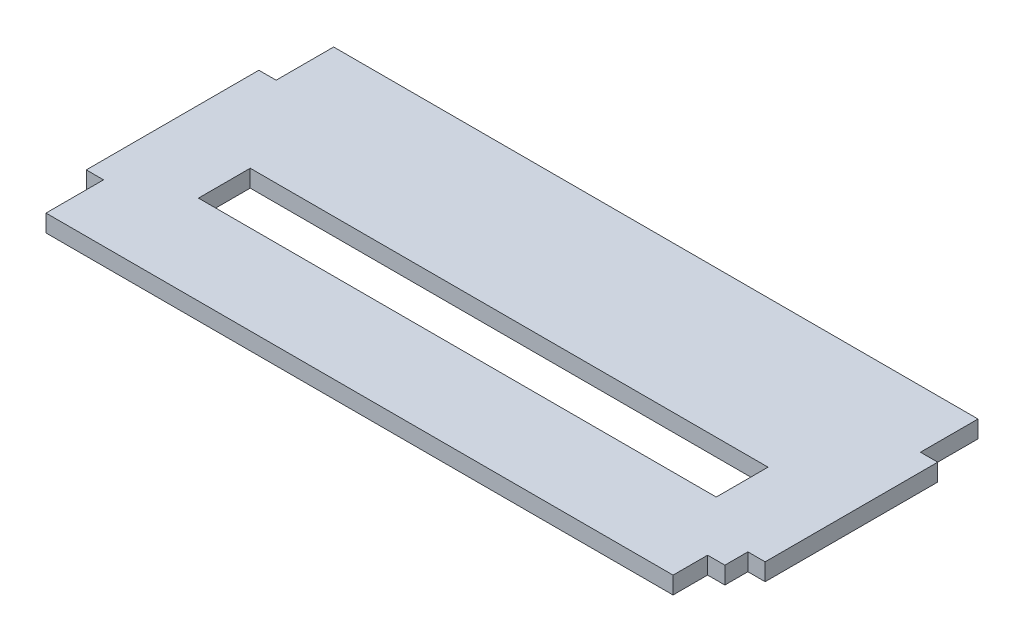
ISO-10303-21;
HEADER;
FILE_DESCRIPTION(('STEP AP214'),'2;1');
FILE_NAME('part.step','',(''),(''),'','','');
FILE_SCHEMA(('AUTOMOTIVE_DESIGN { 1 0 10303 214 1 1 1 1 }'));
ENDSEC;
DATA;
#1=APPLICATION_CONTEXT('core data for automotive mechanical design processes');
#2=APPLICATION_PROTOCOL_DEFINITION('international standard','automotive_design',2000,#1);
#3=PRODUCT_CONTEXT('',#1,'mechanical');
#4=PRODUCT('Part','Part','',(#3));
#5=PRODUCT_RELATED_PRODUCT_CATEGORY('part','',(#4));
#6=PRODUCT_DEFINITION_FORMATION('','',#4);
#7=PRODUCT_DEFINITION_CONTEXT('part definition',#1,'design');
#8=PRODUCT_DEFINITION('design','',#6,#7);
#9=PRODUCT_DEFINITION_SHAPE('','',#8);
#10=(LENGTH_UNIT() NAMED_UNIT(*) SI_UNIT(.MILLI.,.METRE.));
#11=(NAMED_UNIT(*) PLANE_ANGLE_UNIT() SI_UNIT($,.RADIAN.));
#12=(NAMED_UNIT(*) SI_UNIT($,.STERADIAN.) SOLID_ANGLE_UNIT());
#13=UNCERTAINTY_MEASURE_WITH_UNIT(LENGTH_MEASURE(1.E-05),#10,'distance_accuracy_value','');
#14=(GEOMETRIC_REPRESENTATION_CONTEXT(3) GLOBAL_UNCERTAINTY_ASSIGNED_CONTEXT((#13)) GLOBAL_UNIT_ASSIGNED_CONTEXT((#10,
#11,#12)) REPRESENTATION_CONTEXT('',''));
#15=CARTESIAN_POINT('',(0.,0.,0.));
#16=DIRECTION('',(0.,0.,1.));
#17=DIRECTION('',(1.,0.,0.));
#18=AXIS2_PLACEMENT_3D('',#15,#16,#17);
#19=CARTESIAN_POINT('',(-1.5404344466674E-12,12.,139.999999999999));
#20=DIRECTION('',(0.,0.,-1.));
#21=DIRECTION('',(-1.,0.,0.));
#22=AXIS2_PLACEMENT_3D('',#19,#20,#21);
#23=PLANE('',#22);
#24=DIRECTION('',(1.,0.,0.));
#25=VECTOR('',#24,1.);
#26=CARTESIAN_POINT('',(-1.5404344466674E-12,3.,139.999999999999));
#27=LINE('',#26,#25);
#28=CARTESIAN_POINT('',(-3.00000000000154,3.,139.999999999999));
#29=VERTEX_POINT('',#28);
#30=CARTESIAN_POINT('',(-1.5404344466674E-12,3.,139.999999999999));
#31=VERTEX_POINT('',#30);
#32=EDGE_CURVE('E208',#29,#31,#27,.T.);
#33=ORIENTED_EDGE('',*,*,#32,.F.);
#34=DIRECTION('',(0.,1.,0.));
#35=VECTOR('',#34,1.);
#36=CARTESIAN_POINT('',(-3.00000000000154,0.,139.999999999999));
#37=LINE('',#36,#35);
#38=CARTESIAN_POINT('',(-3.00000000000154,0.,139.999999999999));
#39=VERTEX_POINT('',#38);
#40=EDGE_CURVE('E255',#39,#29,#37,.T.);
#41=ORIENTED_EDGE('',*,*,#40,.F.);
#42=DIRECTION('',(1.,0.,0.));
#43=VECTOR('',#42,1.);
#44=CARTESIAN_POINT('',(-1.5404344466674E-12,0.,139.999999999999));
#45=LINE('',#44,#43);
#46=CARTESIAN_POINT('',(-1.5404344466674E-12,0.,139.999999999999));
#47=VERTEX_POINT('',#46);
#48=EDGE_CURVE('E271',#39,#47,#45,.T.);
#49=ORIENTED_EDGE('',*,*,#48,.T.);
#50=DIRECTION('',(0.,1.,0.));
#51=VECTOR('',#50,1.);
#52=CARTESIAN_POINT('',(-1.5404344466674E-12,0.,139.999999999999));
#53=LINE('',#52,#51);
#54=EDGE_CURVE('E227',#47,#31,#53,.T.);
#55=ORIENTED_EDGE('',*,*,#54,.T.);
#56=EDGE_LOOP('',(#33,#41,#49,#55));
#57=FACE_BOUND('',#56,.T.);
#58=ADVANCED_FACE('F34',(#57),#23,.F.);
#59=CARTESIAN_POINT('',(-1.62370117351429E-12,12.,109.999999999999));
#60=DIRECTION('',(0.,0.,-1.));
#61=DIRECTION('',(-1.,0.,0.));
#62=AXIS2_PLACEMENT_3D('',#59,#60,#61);
#63=PLANE('',#62);
#64=DIRECTION('',(0.,1.,0.));
#65=VECTOR('',#64,1.);
#66=CARTESIAN_POINT('',(-2.99999999999846,0.,109.999999999999));
#67=LINE('',#66,#65);
#68=CARTESIAN_POINT('',(-2.99999999999846,0.,109.999999999999));
#69=VERTEX_POINT('',#68);
#70=CARTESIAN_POINT('',(-2.99999999999846,3.,109.999999999999));
#71=VERTEX_POINT('',#70);
#72=EDGE_CURVE('E287',#69,#71,#67,.T.);
#73=ORIENTED_EDGE('',*,*,#72,.T.);
#74=DIRECTION('',(1.,0.,0.));
#75=VECTOR('',#74,1.);
#76=CARTESIAN_POINT('',(-1.62370117351429E-12,3.,109.999999999999));
#77=LINE('',#76,#75);
#78=CARTESIAN_POINT('',(-1.52395457364563E-12,3.,109.999999999999));
#79=VERTEX_POINT('',#78);
#80=EDGE_CURVE('E212',#71,#79,#77,.T.);
#81=ORIENTED_EDGE('',*,*,#80,.T.);
#82=DIRECTION('',(0.,1.,0.));
#83=VECTOR('',#82,1.);
#84=CARTESIAN_POINT('',(-3.05311331771916E-13,0.,109.999999999999));
#85=LINE('',#84,#83);
#86=CARTESIAN_POINT('',(-1.5404344466674E-12,0.,109.999999999999));
#87=VERTEX_POINT('',#86);
#88=EDGE_CURVE('E228',#87,#79,#85,.T.);
#89=ORIENTED_EDGE('',*,*,#88,.F.);
#90=DIRECTION('',(1.,0.,0.));
#91=VECTOR('',#90,1.);
#92=CARTESIAN_POINT('',(-1.62370117351429E-12,0.,109.999999999999));
#93=LINE('',#92,#91);
#94=EDGE_CURVE('E294',#69,#87,#93,.T.);
#95=ORIENTED_EDGE('',*,*,#94,.F.);
#96=EDGE_LOOP('',(#73,#81,#89,#95));
#97=FACE_BOUND('',#96,.T.);
#98=ADVANCED_FACE('F336',(#97),#63,.T.);
#99=CARTESIAN_POINT('',(-118.000000000001,12.,109.999999999999));
#100=DIRECTION('',(0.,0.,1.));
#101=DIRECTION('',(1.,0.,0.));
#102=AXIS2_PLACEMENT_3D('',#99,#100,#101);
#103=PLANE('',#102);
#104=DIRECTION('',(-1.,0.,0.));
#105=VECTOR('',#104,1.);
#106=CARTESIAN_POINT('',(-118.000000000001,3.,109.999999999999));
#107=LINE('',#106,#105);
#108=CARTESIAN_POINT('',(-115.000000000005,3.,109.999999999999));
#109=VERTEX_POINT('',#108);
#110=CARTESIAN_POINT('',(-118.000000000002,3.,109.999999999999));
#111=VERTEX_POINT('',#110);
#112=EDGE_CURVE('E218',#109,#111,#107,.T.);
#113=ORIENTED_EDGE('',*,*,#112,.F.);
#114=DIRECTION('',(0.,1.,0.));
#115=VECTOR('',#114,1.);
#116=CARTESIAN_POINT('',(-115.000000000005,0.,109.999999999999));
#117=LINE('',#116,#115);
#118=CARTESIAN_POINT('',(-115.000000000005,0.,109.999999999999));
#119=VERTEX_POINT('',#118);
#120=EDGE_CURVE('E284',#119,#109,#117,.T.);
#121=ORIENTED_EDGE('',*,*,#120,.F.);
#122=DIRECTION('',(-1.,0.,0.));
#123=VECTOR('',#122,1.);
#124=CARTESIAN_POINT('',(-118.000000000001,0.,109.999999999999));
#125=LINE('',#124,#123);
#126=CARTESIAN_POINT('',(-118.000000000001,0.,109.999999999999));
#127=VERTEX_POINT('',#126);
#128=EDGE_CURVE('E297',#119,#127,#125,.T.);
#129=ORIENTED_EDGE('',*,*,#128,.T.);
#130=DIRECTION('',(0.,1.,0.));
#131=VECTOR('',#130,1.);
#132=CARTESIAN_POINT('',(-118.000000000001,0.,109.999999999999));
#133=LINE('',#132,#131);
#134=EDGE_CURVE('E237',#127,#111,#133,.T.);
#135=ORIENTED_EDGE('',*,*,#134,.T.);
#136=EDGE_LOOP('',(#113,#121,#129,#135));
#137=FACE_BOUND('',#136,.T.);
#138=ADVANCED_FACE('F322',(#137),#103,.F.);
#139=CARTESIAN_POINT('',(-118.000000000002,12.,139.999999999999));
#140=DIRECTION('',(0.,0.,1.));
#141=DIRECTION('',(1.,0.,0.));
#142=AXIS2_PLACEMENT_3D('',#139,#140,#141);
#143=PLANE('',#142);
#144=DIRECTION('',(0.,1.,0.));
#145=VECTOR('',#144,1.);
#146=CARTESIAN_POINT('',(-115.000000000002,0.,139.999999999999));
#147=LINE('',#146,#145);
#148=CARTESIAN_POINT('',(-115.000000000002,0.,139.999999999999));
#149=VERTEX_POINT('',#148);
#150=CARTESIAN_POINT('',(-115.000000000002,3.,139.999999999999));
#151=VERTEX_POINT('',#150);
#152=EDGE_CURVE('E266',#149,#151,#147,.T.);
#153=ORIENTED_EDGE('',*,*,#152,.T.);
#154=DIRECTION('',(-1.,0.,0.));
#155=VECTOR('',#154,1.);
#156=CARTESIAN_POINT('',(-118.000000000002,3.,139.999999999999));
#157=LINE('',#156,#155);
#158=CARTESIAN_POINT('',(-118.000000000002,3.,139.999999999999));
#159=VERTEX_POINT('',#158);
#160=EDGE_CURVE('E222',#151,#159,#157,.T.);
#161=ORIENTED_EDGE('',*,*,#160,.T.);
#162=DIRECTION('',(0.,1.,0.));
#163=VECTOR('',#162,1.);
#164=CARTESIAN_POINT('',(-118.000000000002,0.,139.999999999999));
#165=LINE('',#164,#163);
#166=CARTESIAN_POINT('',(-118.000000000001,0.,139.999999999999));
#167=VERTEX_POINT('',#166);
#168=EDGE_CURVE('E236',#167,#159,#165,.T.);
#169=ORIENTED_EDGE('',*,*,#168,.F.);
#170=DIRECTION('',(-1.,0.,0.));
#171=VECTOR('',#170,1.);
#172=CARTESIAN_POINT('',(-118.000000000002,0.,139.999999999999));
#173=LINE('',#172,#171);
#174=EDGE_CURVE('E300',#149,#167,#173,.T.);
#175=ORIENTED_EDGE('',*,*,#174,.F.);
#176=EDGE_LOOP('',(#153,#161,#169,#175));
#177=FACE_BOUND('',#176,.T.);
#178=ADVANCED_FACE('F315',(#177),#143,.T.);
#179=CARTESIAN_POINT('',(-1.5404344466674E-12,12.,149.999999999999));
#180=DIRECTION('',(0.,0.,1.));
#181=DIRECTION('',(1.,0.,0.));
#182=AXIS2_PLACEMENT_3D('',#179,#180,#181);
#183=PLANE('',#182);
#184=DIRECTION('',(0.,1.,0.));
#185=VECTOR('',#184,1.);
#186=CARTESIAN_POINT('',(-6.00197015274353,0.,149.999999999999));
#187=LINE('',#186,#185);
#188=CARTESIAN_POINT('',(-6.00197015274353,0.,149.999999999999));
#189=VERTEX_POINT('',#188);
#190=CARTESIAN_POINT('',(-6.00197015274354,3.,149.999999999999));
#191=VERTEX_POINT('',#190);
#192=EDGE_CURVE('E258',#189,#191,#187,.T.);
#193=ORIENTED_EDGE('',*,*,#192,.T.);
#194=DIRECTION('',(1.,0.,0.));
#195=VECTOR('',#194,1.);
#196=CARTESIAN_POINT('',(-118.000000000002,3.,149.999999999999));
#197=LINE('',#196,#195);
#198=CARTESIAN_POINT('',(-115.000000000002,3.,149.999999999999));
#199=VERTEX_POINT('',#198);
#200=EDGE_CURVE('E196',#199,#191,#197,.T.);
#201=ORIENTED_EDGE('',*,*,#200,.F.);
#202=DIRECTION('',(0.,1.,0.));
#203=VECTOR('',#202,1.);
#204=CARTESIAN_POINT('',(-115.000000000002,0.,149.999999999999));
#205=LINE('',#204,#203);
#206=CARTESIAN_POINT('',(-115.000000000002,0.,149.999999999999));
#207=VERTEX_POINT('',#206);
#208=EDGE_CURVE('E268',#207,#199,#205,.T.);
#209=ORIENTED_EDGE('',*,*,#208,.F.);
#210=DIRECTION('',(-1.,0.,0.));
#211=VECTOR('',#210,1.);
#212=CARTESIAN_POINT('',(-1.5404344466674E-12,0.,149.999999999999));
#213=LINE('',#212,#211);
#214=EDGE_CURVE('E41',#189,#207,#213,.T.);
#215=ORIENTED_EDGE('',*,*,#214,.F.);
#216=EDGE_LOOP('',(#193,#201,#209,#215));
#217=FACE_BOUND('',#216,.T.);
#218=ADVANCED_FACE('F308',(#217),#183,.T.);
#219=CARTESIAN_POINT('',(-115.000000000002,0.,0.));
#220=DIRECTION('',(1.,0.,0.));
#221=DIRECTION('',(0.,0.,-1.));
#222=AXIS2_PLACEMENT_3D('',#219,#220,#221);
#223=PLANE('',#222);
#224=DIRECTION('',(0.,0.,1.));
#225=VECTOR('',#224,1.);
#226=CARTESIAN_POINT('',(-115.000000000002,3.,0.));
#227=LINE('',#226,#225);
#228=EDGE_CURVE('E220',#151,#199,#227,.T.);
#229=ORIENTED_EDGE('',*,*,#228,.F.);
#230=ORIENTED_EDGE('',*,*,#152,.F.);
#231=DIRECTION('',(0.,0.,-1.));
#232=VECTOR('',#231,1.);
#233=CARTESIAN_POINT('',(-115.000000000002,0.,0.));
#234=LINE('',#233,#232);
#235=EDGE_CURVE('E263',#207,#149,#234,.T.);
#236=ORIENTED_EDGE('',*,*,#235,.F.);
#237=ORIENTED_EDGE('',*,*,#208,.T.);
#238=EDGE_LOOP('',(#229,#230,#236,#237));
#239=FACE_BOUND('',#238,.T.);
#240=ADVANCED_FACE('F312',(#239),#223,.F.);
#241=CARTESIAN_POINT('',(0.,0.,99.9999999999988));
#242=DIRECTION('',(0.,0.,-1.));
#243=DIRECTION('',(-1.,0.,0.));
#244=AXIS2_PLACEMENT_3D('',#241,#242,#243);
#245=PLANE('',#244);
#246=DIRECTION('',(0.,1.,0.));
#247=VECTOR('',#246,1.);
#248=CARTESIAN_POINT('',(-115.000000000005,0.,99.9999999999988));
#249=LINE('',#248,#247);
#250=CARTESIAN_POINT('',(-115.000000000005,0.,99.9999999999988));
#251=VERTEX_POINT('',#250);
#252=CARTESIAN_POINT('',(-115.000000000005,3.,99.9999999999988));
#253=VERTEX_POINT('',#252);
#254=EDGE_CURVE('E267',#251,#253,#249,.T.);
#255=ORIENTED_EDGE('',*,*,#254,.T.);
#256=DIRECTION('',(-1.,0.,0.));
#257=VECTOR('',#256,1.);
#258=CARTESIAN_POINT('',(-118.000000000002,3.,99.9999999999988));
#259=LINE('',#258,#257);
#260=CARTESIAN_POINT('',(-2.99999999999846,3.,99.9999999999988));
#261=VERTEX_POINT('',#260);
#262=EDGE_CURVE('E198',#261,#253,#259,.T.);
#263=ORIENTED_EDGE('',*,*,#262,.F.);
#264=DIRECTION('',(0.,1.,0.));
#265=VECTOR('',#264,1.);
#266=CARTESIAN_POINT('',(-2.99999999999846,0.,99.9999999999988));
#267=LINE('',#266,#265);
#268=CARTESIAN_POINT('',(-2.99999999999846,0.,99.9999999999988));
#269=VERTEX_POINT('',#268);
#270=EDGE_CURVE('E281',#269,#261,#267,.T.);
#271=ORIENTED_EDGE('',*,*,#270,.F.);
#272=DIRECTION('',(-1.,0.,0.));
#273=VECTOR('',#272,1.);
#274=CARTESIAN_POINT('',(0.,0.,99.9999999999988));
#275=LINE('',#274,#273);
#276=EDGE_CURVE('E254',#269,#251,#275,.T.);
#277=ORIENTED_EDGE('',*,*,#276,.T.);
#278=EDGE_LOOP('',(#255,#263,#271,#277));
#279=FACE_BOUND('',#278,.T.);
#280=ADVANCED_FACE('F329',(#279),#245,.T.);
#281=CARTESIAN_POINT('',(-115.000000000005,0.,0.));
#282=DIRECTION('',(-1.,0.,0.));
#283=DIRECTION('',(0.,0.,1.));
#284=AXIS2_PLACEMENT_3D('',#281,#282,#283);
#285=PLANE('',#284);
#286=ORIENTED_EDGE('',*,*,#120,.T.);
#287=DIRECTION('',(0.,0.,-1.));
#288=VECTOR('',#287,1.);
#289=CARTESIAN_POINT('',(-115.000000000005,3.,0.));
#290=LINE('',#289,#288);
#291=EDGE_CURVE('E215',#109,#253,#290,.T.);
#292=ORIENTED_EDGE('',*,*,#291,.T.);
#293=ORIENTED_EDGE('',*,*,#254,.F.);
#294=DIRECTION('',(0.,0.,1.));
#295=VECTOR('',#294,1.);
#296=CARTESIAN_POINT('',(-115.000000000005,0.,0.));
#297=LINE('',#296,#295);
#298=EDGE_CURVE('E278',#251,#119,#297,.T.);
#299=ORIENTED_EDGE('',*,*,#298,.T.);
#300=EDGE_LOOP('',(#286,#292,#293,#299));
#301=FACE_BOUND('',#300,.T.);
#302=ADVANCED_FACE('F324',(#301),#285,.T.);
#303=CARTESIAN_POINT('',(-2.99999999999846,0.,0.));
#304=DIRECTION('',(-1.,0.,0.));
#305=DIRECTION('',(0.,0.,1.));
#306=AXIS2_PLACEMENT_3D('',#303,#304,#305);
#307=PLANE('',#306);
#308=DIRECTION('',(0.,0.,-1.));
#309=VECTOR('',#308,1.);
#310=CARTESIAN_POINT('',(-2.99999999999846,3.,0.));
#311=LINE('',#310,#309);
#312=EDGE_CURVE('E210',#71,#261,#311,.T.);
#313=ORIENTED_EDGE('',*,*,#312,.F.);
#314=ORIENTED_EDGE('',*,*,#72,.F.);
#315=DIRECTION('',(0.,0.,1.));
#316=VECTOR('',#315,1.);
#317=CARTESIAN_POINT('',(-2.99999999999846,0.,0.));
#318=LINE('',#317,#316);
#319=EDGE_CURVE('E275',#269,#69,#318,.T.);
#320=ORIENTED_EDGE('',*,*,#319,.F.);
#321=ORIENTED_EDGE('',*,*,#270,.T.);
#322=EDGE_LOOP('',(#313,#314,#320,#321));
#323=FACE_BOUND('',#322,.T.);
#324=ADVANCED_FACE('F334',(#323),#307,.F.);
#325=CARTESIAN_POINT('',(0.,0.,143.999999999999));
#326=DIRECTION('',(0.,0.,1.));
#327=DIRECTION('',(1.,0.,0.));
#328=AXIS2_PLACEMENT_3D('',#325,#326,#327);
#329=PLANE('',#328);
#330=DIRECTION('',(0.,1.,0.));
#331=VECTOR('',#330,1.);
#332=CARTESIAN_POINT('',(-3.00000000000154,0.,143.999999999999));
#333=LINE('',#332,#331);
#334=CARTESIAN_POINT('',(-3.00000000000154,0.,143.999999999999));
#335=VERTEX_POINT('',#334);
#336=CARTESIAN_POINT('',(-3.00000000000154,3.,143.999999999999));
#337=VERTEX_POINT('',#336);
#338=EDGE_CURVE('E251',#335,#337,#333,.T.);
#339=ORIENTED_EDGE('',*,*,#338,.T.);
#340=DIRECTION('',(-1.,0.,0.));
#341=VECTOR('',#340,1.);
#342=CARTESIAN_POINT('',(0.,3.,143.999999999999));
#343=LINE('',#342,#341);
#344=CARTESIAN_POINT('',(-6.00197015274353,3.,143.999999999999));
#345=VERTEX_POINT('',#344);
#346=EDGE_CURVE('E202',#337,#345,#343,.T.);
#347=ORIENTED_EDGE('',*,*,#346,.T.);
#348=DIRECTION('',(0.,1.,0.));
#349=VECTOR('',#348,1.);
#350=CARTESIAN_POINT('',(-6.00197015274353,0.,143.999999999999));
#351=LINE('',#350,#349);
#352=CARTESIAN_POINT('',(-6.00197015274353,0.,143.999999999999));
#353=VERTEX_POINT('',#352);
#354=EDGE_CURVE('E250',#353,#345,#351,.T.);
#355=ORIENTED_EDGE('',*,*,#354,.F.);
#356=DIRECTION('',(1.,0.,0.));
#357=VECTOR('',#356,1.);
#358=CARTESIAN_POINT('',(0.,0.,143.999999999999));
#359=LINE('',#358,#357);
#360=EDGE_CURVE('E240',#353,#335,#359,.T.);
#361=ORIENTED_EDGE('',*,*,#360,.T.);
#362=EDGE_LOOP('',(#339,#347,#355,#361));
#363=FACE_BOUND('',#362,.T.);
#364=ADVANCED_FACE('F348',(#363),#329,.T.);
#365=CARTESIAN_POINT('',(-3.00000000000154,0.,0.));
#366=DIRECTION('',(1.,0.,0.));
#367=DIRECTION('',(0.,0.,-1.));
#368=AXIS2_PLACEMENT_3D('',#365,#366,#367);
#369=PLANE('',#368);
#370=ORIENTED_EDGE('',*,*,#40,.T.);
#371=DIRECTION('',(0.,0.,1.));
#372=VECTOR('',#371,1.);
#373=CARTESIAN_POINT('',(-3.00000000000154,3.,0.));
#374=LINE('',#373,#372);
#375=EDGE_CURVE('E205',#29,#337,#374,.T.);
#376=ORIENTED_EDGE('',*,*,#375,.T.);
#377=ORIENTED_EDGE('',*,*,#338,.F.);
#378=DIRECTION('',(0.,0.,-1.));
#379=VECTOR('',#378,1.);
#380=CARTESIAN_POINT('',(-3.00000000000154,0.,0.));
#381=LINE('',#380,#379);
#382=EDGE_CURVE('E247',#335,#39,#381,.T.);
#383=ORIENTED_EDGE('',*,*,#382,.T.);
#384=EDGE_LOOP('',(#370,#376,#377,#383));
#385=FACE_BOUND('',#384,.T.);
#386=ADVANCED_FACE('F345',(#385),#369,.T.);
#387=CARTESIAN_POINT('',(-6.00197015274355,0.,0.));
#388=DIRECTION('',(-1.,0.,0.));
#389=DIRECTION('',(0.,0.,1.));
#390=AXIS2_PLACEMENT_3D('',#387,#388,#389);
#391=PLANE('',#390);
#392=DIRECTION('',(0.,0.,-1.));
#393=VECTOR('',#392,1.);
#394=CARTESIAN_POINT('',(-6.00197015274355,3.,0.));
#395=LINE('',#394,#393);
#396=EDGE_CURVE('E200',#191,#345,#395,.T.);
#397=ORIENTED_EDGE('',*,*,#396,.F.);
#398=ORIENTED_EDGE('',*,*,#192,.F.);
#399=DIRECTION('',(0.,0.,1.));
#400=VECTOR('',#399,1.);
#401=CARTESIAN_POINT('',(-6.00197015274355,0.,0.));
#402=LINE('',#401,#400);
#403=EDGE_CURVE('E244',#353,#189,#402,.T.);
#404=ORIENTED_EDGE('',*,*,#403,.F.);
#405=ORIENTED_EDGE('',*,*,#354,.T.);
#406=EDGE_LOOP('',(#397,#398,#404,#405));
#407=FACE_BOUND('',#406,.T.);
#408=ADVANCED_FACE('F351',(#407),#391,.F.);
#409=CARTESIAN_POINT('',(-118.000000000002,0.,0.));
#410=DIRECTION('',(1.,0.,0.));
#411=DIRECTION('',(0.,0.,-1.));
#412=AXIS2_PLACEMENT_3D('',#409,#410,#411);
#413=PLANE('',#412);
#414=DIRECTION('',(0.,0.,1.));
#415=VECTOR('',#414,1.);
#416=CARTESIAN_POINT('',(-118.000000000002,3.,99.9999999999988));
#417=LINE('',#416,#415);
#418=EDGE_CURVE('E191',#111,#159,#417,.T.);
#419=ORIENTED_EDGE('',*,*,#418,.F.);
#420=ORIENTED_EDGE('',*,*,#134,.F.);
#421=DIRECTION('',(0.,0.,-1.));
#422=VECTOR('',#421,1.);
#423=CARTESIAN_POINT('',(-118.000000000002,0.,0.));
#424=LINE('',#423,#422);
#425=EDGE_CURVE('E231',#167,#127,#424,.T.);
#426=ORIENTED_EDGE('',*,*,#425,.F.);
#427=ORIENTED_EDGE('',*,*,#168,.T.);
#428=EDGE_LOOP('',(#419,#420,#426,#427));
#429=FACE_BOUND('',#428,.T.);
#430=ADVANCED_FACE('F355',(#429),#413,.F.);
#431=CARTESIAN_POINT('',(0.,0.,0.));
#432=DIRECTION('',(1.,0.,0.));
#433=DIRECTION('',(0.,0.,-1.));
#434=AXIS2_PLACEMENT_3D('',#431,#432,#433);
#435=PLANE('',#434);
#436=ORIENTED_EDGE('',*,*,#88,.T.);
#437=DIRECTION('',(0.,0.,1.));
#438=VECTOR('',#437,1.);
#439=CARTESIAN_POINT('',(0.,3.,0.));
#440=LINE('',#439,#438);
#441=EDGE_CURVE('E11',#79,#31,#440,.T.);
#442=ORIENTED_EDGE('',*,*,#441,.T.);
#443=ORIENTED_EDGE('',*,*,#54,.F.);
#444=DIRECTION('',(0.,0.,-1.));
#445=VECTOR('',#444,1.);
#446=CARTESIAN_POINT('',(0.,0.,0.));
#447=LINE('',#446,#445);
#448=EDGE_CURVE('E225',#47,#87,#447,.T.);
#449=ORIENTED_EDGE('',*,*,#448,.T.);
#450=EDGE_LOOP('',(#436,#442,#443,#449));
#451=FACE_BOUND('',#450,.T.);
#452=ADVANCED_FACE('F357',(#451),#435,.T.);
#453=CARTESIAN_POINT('',(0.,0.,0.));
#454=DIRECTION('',(0.,-1.,0.));
#455=DIRECTION('',(0.,0.,-1.));
#456=AXIS2_PLACEMENT_3D('',#453,#454,#455);
#457=PLANE('',#456);
#458=DIRECTION('',(0.,0.,-1.));
#459=VECTOR('',#458,1.);
#460=CARTESIAN_POINT('',(-14.0000000000016,0.,125.499999999999));
#461=LINE('',#460,#459);
#462=CARTESIAN_POINT('',(-14.0000000000016,0.,134.499999999999));
#463=VERTEX_POINT('',#462);
#464=CARTESIAN_POINT('',(-14.0000000000016,0.,125.499999999999));
#465=VERTEX_POINT('',#464);
#466=EDGE_CURVE('E160',#463,#465,#461,.T.);
#467=ORIENTED_EDGE('',*,*,#466,.T.);
#468=DIRECTION('',(-1.,0.,0.));
#469=VECTOR('',#468,1.);
#470=CARTESIAN_POINT('',(-104.000000000002,0.,125.499999999999));
#471=LINE('',#470,#469);
#472=CARTESIAN_POINT('',(-104.000000000002,0.,125.499999999999));
#473=VERTEX_POINT('',#472);
#474=EDGE_CURVE('E169',#465,#473,#471,.T.);
#475=ORIENTED_EDGE('',*,*,#474,.T.);
#476=DIRECTION('',(0.,0.,1.));
#477=VECTOR('',#476,1.);
#478=CARTESIAN_POINT('',(-104.000000000002,0.,125.499999999999));
#479=LINE('',#478,#477);
#480=CARTESIAN_POINT('',(-104.000000000002,0.,134.499999999999));
#481=VERTEX_POINT('',#480);
#482=EDGE_CURVE('E48',#473,#481,#479,.T.);
#483=ORIENTED_EDGE('',*,*,#482,.T.);
#484=DIRECTION('',(1.,0.,0.));
#485=VECTOR('',#484,1.);
#486=CARTESIAN_POINT('',(-104.000000000002,0.,134.499999999999));
#487=LINE('',#486,#485);
#488=EDGE_CURVE('E166',#481,#463,#487,.T.);
#489=ORIENTED_EDGE('',*,*,#488,.T.);
#490=EDGE_LOOP('',(#467,#475,#483,#489));
#491=FACE_BOUND('',#490,.T.);
#492=ORIENTED_EDGE('',*,*,#94,.T.);
#493=ORIENTED_EDGE('',*,*,#448,.F.);
#494=ORIENTED_EDGE('',*,*,#48,.F.);
#495=ORIENTED_EDGE('',*,*,#382,.F.);
#496=ORIENTED_EDGE('',*,*,#360,.F.);
#497=ORIENTED_EDGE('',*,*,#403,.T.);
#498=ORIENTED_EDGE('',*,*,#214,.T.);
#499=ORIENTED_EDGE('',*,*,#235,.T.);
#500=ORIENTED_EDGE('',*,*,#174,.T.);
#501=ORIENTED_EDGE('',*,*,#425,.T.);
#502=ORIENTED_EDGE('',*,*,#128,.F.);
#503=ORIENTED_EDGE('',*,*,#298,.F.);
#504=ORIENTED_EDGE('',*,*,#276,.F.);
#505=ORIENTED_EDGE('',*,*,#319,.T.);
#506=EDGE_LOOP('',(#492,#493,#494,#495,#496,#497,#498,#499,#500,#501,#502,#503,#504,#505));
#507=FACE_BOUND('',#506,.T.);
#508=ADVANCED_FACE('F173',(#491,#507),#457,.T.);
#509=CARTESIAN_POINT('',(0.,3.,0.));
#510=DIRECTION('',(0.,1.,0.));
#511=DIRECTION('',(0.,0.,1.));
#512=AXIS2_PLACEMENT_3D('',#509,#510,#511);
#513=PLANE('',#512);
#514=DIRECTION('',(0.,0.,-1.));
#515=VECTOR('',#514,1.);
#516=CARTESIAN_POINT('',(-14.0000000000016,3.,125.499999999999));
#517=LINE('',#516,#515);
#518=CARTESIAN_POINT('',(-14.0000000000016,3.,134.499999999999));
#519=VERTEX_POINT('',#518);
#520=CARTESIAN_POINT('',(-14.0000000000016,3.,125.499999999999));
#521=VERTEX_POINT('',#520);
#522=EDGE_CURVE('E56',#519,#521,#517,.T.);
#523=ORIENTED_EDGE('',*,*,#522,.F.);
#524=DIRECTION('',(1.,0.,0.));
#525=VECTOR('',#524,1.);
#526=CARTESIAN_POINT('',(-104.000000000002,3.,134.499999999999));
#527=LINE('',#526,#525);
#528=CARTESIAN_POINT('',(-104.000000000002,3.,134.499999999999));
#529=VERTEX_POINT('',#528);
#530=EDGE_CURVE('E176',#529,#519,#527,.T.);
#531=ORIENTED_EDGE('',*,*,#530,.F.);
#532=DIRECTION('',(0.,0.,1.));
#533=VECTOR('',#532,1.);
#534=CARTESIAN_POINT('',(-104.000000000002,3.,125.499999999999));
#535=LINE('',#534,#533);
#536=CARTESIAN_POINT('',(-104.000000000002,3.,125.499999999999));
#537=VERTEX_POINT('',#536);
#538=EDGE_CURVE('E179',#537,#529,#535,.T.);
#539=ORIENTED_EDGE('',*,*,#538,.F.);
#540=DIRECTION('',(-1.,0.,0.));
#541=VECTOR('',#540,1.);
#542=CARTESIAN_POINT('',(-104.000000000002,3.,125.499999999999));
#543=LINE('',#542,#541);
#544=EDGE_CURVE('E185',#521,#537,#543,.T.);
#545=ORIENTED_EDGE('',*,*,#544,.F.);
#546=EDGE_LOOP('',(#523,#531,#539,#545));
#547=FACE_BOUND('',#546,.T.);
#548=ORIENTED_EDGE('',*,*,#228,.T.);
#549=ORIENTED_EDGE('',*,*,#200,.T.);
#550=ORIENTED_EDGE('',*,*,#396,.T.);
#551=ORIENTED_EDGE('',*,*,#346,.F.);
#552=ORIENTED_EDGE('',*,*,#375,.F.);
#553=ORIENTED_EDGE('',*,*,#32,.T.);
#554=ORIENTED_EDGE('',*,*,#441,.F.);
#555=ORIENTED_EDGE('',*,*,#80,.F.);
#556=ORIENTED_EDGE('',*,*,#312,.T.);
#557=ORIENTED_EDGE('',*,*,#262,.T.);
#558=ORIENTED_EDGE('',*,*,#291,.F.);
#559=ORIENTED_EDGE('',*,*,#112,.T.);
#560=ORIENTED_EDGE('',*,*,#418,.T.);
#561=ORIENTED_EDGE('',*,*,#160,.F.);
#562=EDGE_LOOP('',(#548,#549,#550,#551,#552,#553,#554,#555,#556,#557,#558,#559,#560,#561));
#563=FACE_BOUND('',#562,.T.);
#564=ADVANCED_FACE('F353',(#547,#563),#513,.T.);
#565=CARTESIAN_POINT('',(-14.0000000000016,0.,125.499999999999));
#566=DIRECTION('',(1.,0.,0.));
#567=DIRECTION('',(0.,0.,-1.));
#568=AXIS2_PLACEMENT_3D('',#565,#566,#567);
#569=PLANE('',#568);
#570=ORIENTED_EDGE('',*,*,#522,.T.);
#571=DIRECTION('',(0.,1.,0.));
#572=VECTOR('',#571,1.);
#573=CARTESIAN_POINT('',(-14.0000000000016,0.,125.499999999999));
#574=LINE('',#573,#572);
#575=EDGE_CURVE('E156',#465,#521,#574,.T.);
#576=ORIENTED_EDGE('',*,*,#575,.F.);
#577=ORIENTED_EDGE('',*,*,#466,.F.);
#578=DIRECTION('',(0.,1.,0.));
#579=VECTOR('',#578,1.);
#580=CARTESIAN_POINT('',(-14.0000000000016,0.,134.499999999999));
#581=LINE('',#580,#579);
#582=EDGE_CURVE('E189',#463,#519,#581,.T.);
#583=ORIENTED_EDGE('',*,*,#582,.T.);
#584=EDGE_LOOP('',(#570,#576,#577,#583));
#585=FACE_BOUND('',#584,.T.);
#586=ADVANCED_FACE('F158',(#585),#569,.F.);
#587=CARTESIAN_POINT('',(-104.000000000002,0.,134.499999999999));
#588=DIRECTION('',(0.,0.,1.));
#589=DIRECTION('',(1.,0.,0.));
#590=AXIS2_PLACEMENT_3D('',#587,#588,#589);
#591=PLANE('',#590);
#592=ORIENTED_EDGE('',*,*,#530,.T.);
#593=ORIENTED_EDGE('',*,*,#582,.F.);
#594=ORIENTED_EDGE('',*,*,#488,.F.);
#595=DIRECTION('',(0.,1.,0.));
#596=VECTOR('',#595,1.);
#597=CARTESIAN_POINT('',(-104.000000000002,0.,134.499999999999));
#598=LINE('',#597,#596);
#599=EDGE_CURVE('E192',#481,#529,#598,.T.);
#600=ORIENTED_EDGE('',*,*,#599,.T.);
#601=EDGE_LOOP('',(#592,#593,#594,#600));
#602=FACE_BOUND('',#601,.T.);
#603=ADVANCED_FACE('F435',(#602),#591,.F.);
#604=CARTESIAN_POINT('',(-104.000000000002,0.,125.499999999999));
#605=DIRECTION('',(-1.,0.,0.));
#606=DIRECTION('',(0.,0.,1.));
#607=AXIS2_PLACEMENT_3D('',#604,#605,#606);
#608=PLANE('',#607);
#609=ORIENTED_EDGE('',*,*,#538,.T.);
#610=ORIENTED_EDGE('',*,*,#599,.F.);
#611=ORIENTED_EDGE('',*,*,#482,.F.);
#612=DIRECTION('',(0.,1.,0.));
#613=VECTOR('',#612,1.);
#614=CARTESIAN_POINT('',(-104.000000000002,0.,125.499999999999));
#615=LINE('',#614,#613);
#616=EDGE_CURVE('E165',#473,#537,#615,.T.);
#617=ORIENTED_EDGE('',*,*,#616,.T.);
#618=EDGE_LOOP('',(#609,#610,#611,#617));
#619=FACE_BOUND('',#618,.T.);
#620=ADVANCED_FACE('F443',(#619),#608,.F.);
#621=CARTESIAN_POINT('',(-104.000000000002,0.,125.499999999999));
#622=DIRECTION('',(0.,0.,-1.));
#623=DIRECTION('',(-1.,0.,0.));
#624=AXIS2_PLACEMENT_3D('',#621,#622,#623);
#625=PLANE('',#624);
#626=ORIENTED_EDGE('',*,*,#544,.T.);
#627=ORIENTED_EDGE('',*,*,#616,.F.);
#628=ORIENTED_EDGE('',*,*,#474,.F.);
#629=ORIENTED_EDGE('',*,*,#575,.T.);
#630=EDGE_LOOP('',(#626,#627,#628,#629));
#631=FACE_BOUND('',#630,.T.);
#632=ADVANCED_FACE('F170',(#631),#625,.F.);
#633=CLOSED_SHELL('',(#58,#98,#138,#178,#218,#240,#280,#302,#324,#364,#386,#408,#430,#452,#508,
#564,#586,#603,#620,#632));
#634=MANIFOLD_SOLID_BREP('B2',#633);
#635=ADVANCED_BREP_SHAPE_REPRESENTATION('',(#18,#634),#14);
#636=SHAPE_DEFINITION_REPRESENTATION(#9,#635);
ENDSEC;
END-ISO-10303-21;
